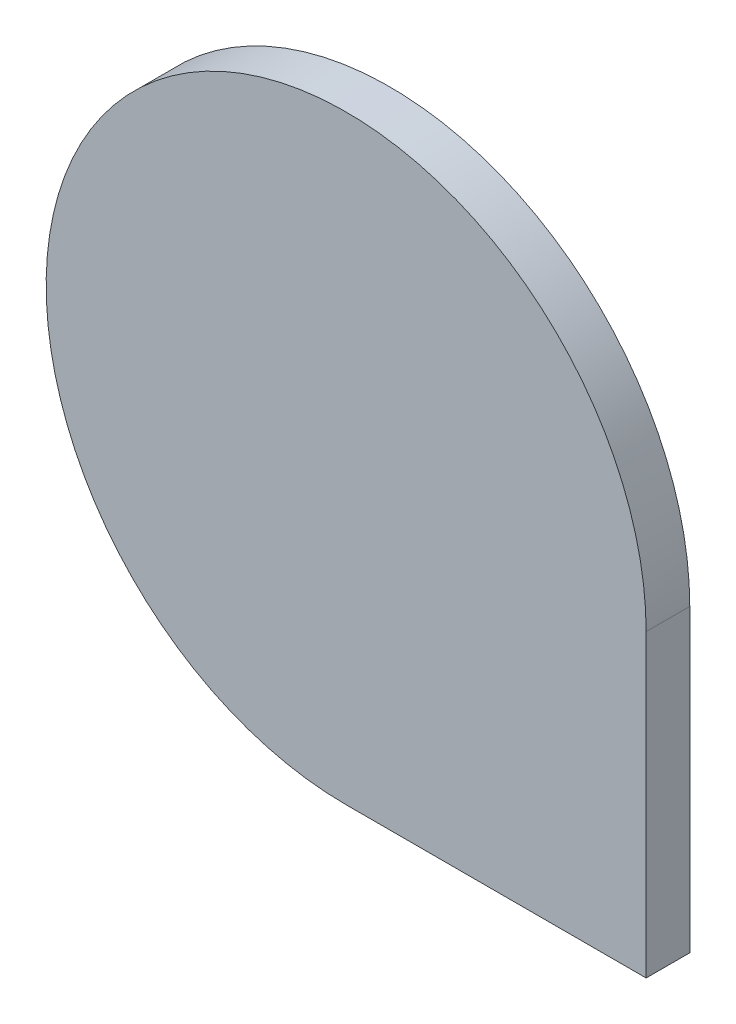
ISO-10303-21;
HEADER;
FILE_DESCRIPTION(('STEP AP214'),'2;1');
FILE_NAME('part.step','',(''),(''),'','','');
FILE_SCHEMA(('AUTOMOTIVE_DESIGN { 1 0 10303 214 1 1 1 1 }'));
ENDSEC;
DATA;
#1=APPLICATION_CONTEXT('core data for automotive mechanical design processes');
#2=APPLICATION_PROTOCOL_DEFINITION('international standard','automotive_design',2000,#1);
#3=PRODUCT_CONTEXT('',#1,'mechanical');
#4=PRODUCT('Part','Part','',(#3));
#5=PRODUCT_RELATED_PRODUCT_CATEGORY('part','',(#4));
#6=PRODUCT_DEFINITION_FORMATION('','',#4);
#7=PRODUCT_DEFINITION_CONTEXT('part definition',#1,'design');
#8=PRODUCT_DEFINITION('design','',#6,#7);
#9=PRODUCT_DEFINITION_SHAPE('','',#8);
#10=(LENGTH_UNIT() NAMED_UNIT(*) SI_UNIT(.MILLI.,.METRE.));
#11=(NAMED_UNIT(*) PLANE_ANGLE_UNIT() SI_UNIT($,.RADIAN.));
#12=(NAMED_UNIT(*) SI_UNIT($,.STERADIAN.) SOLID_ANGLE_UNIT());
#13=UNCERTAINTY_MEASURE_WITH_UNIT(LENGTH_MEASURE(1.E-05),#10,'distance_accuracy_value','');
#14=(GEOMETRIC_REPRESENTATION_CONTEXT(3) GLOBAL_UNCERTAINTY_ASSIGNED_CONTEXT((#13)) GLOBAL_UNIT_ASSIGNED_CONTEXT((#10,
#11,#12)) REPRESENTATION_CONTEXT('',''));
#15=CARTESIAN_POINT('',(0.,0.,0.));
#16=DIRECTION('',(0.,0.,1.));
#17=DIRECTION('',(1.,0.,0.));
#18=AXIS2_PLACEMENT_3D('',#15,#16,#17);
#19=CARTESIAN_POINT('',(0.,0.,8.));
#20=DIRECTION('',(0.,0.,-1.));
#21=DIRECTION('',(-1.,0.,0.));
#22=AXIS2_PLACEMENT_3D('',#19,#20,#21);
#23=CYLINDRICAL_SURFACE('',#22,55.);
#24=CARTESIAN_POINT('',(0.,0.,0.));
#25=DIRECTION('',(0.,0.,1.));
#26=DIRECTION('',(1.,0.,0.));
#27=AXIS2_PLACEMENT_3D('',#24,#25,#26);
#28=CIRCLE('',#27,55.);
#29=CARTESIAN_POINT('',(55.,0.,0.));
#30=VERTEX_POINT('',#29);
#31=CARTESIAN_POINT('',(0.,-55.,0.));
#32=VERTEX_POINT('',#31);
#33=EDGE_CURVE('E93',#30,#32,#28,.T.);
#34=ORIENTED_EDGE('',*,*,#33,.T.);
#35=DIRECTION('',(0.,0.,-1.));
#36=VECTOR('',#35,1.);
#37=CARTESIAN_POINT('',(0.,-55.,8.));
#38=LINE('',#37,#36);
#39=CARTESIAN_POINT('',(0.,-55.,8.));
#40=VERTEX_POINT('',#39);
#41=EDGE_CURVE('E11',#40,#32,#38,.T.);
#42=ORIENTED_EDGE('',*,*,#41,.F.);
#43=CARTESIAN_POINT('',(0.,0.,8.));
#44=DIRECTION('',(0.,0.,1.));
#45=DIRECTION('',(1.,0.,0.));
#46=AXIS2_PLACEMENT_3D('',#43,#44,#45);
#47=CIRCLE('',#46,55.);
#48=CARTESIAN_POINT('',(55.,0.,8.));
#49=VERTEX_POINT('',#48);
#50=EDGE_CURVE('E85',#49,#40,#47,.T.);
#51=ORIENTED_EDGE('',*,*,#50,.F.);
#52=DIRECTION('',(0.,0.,-1.));
#53=VECTOR('',#52,1.);
#54=CARTESIAN_POINT('',(55.,0.,8.));
#55=LINE('',#54,#53);
#56=EDGE_CURVE('E94',#49,#30,#55,.T.);
#57=ORIENTED_EDGE('',*,*,#56,.T.);
#58=EDGE_LOOP('',(#34,#42,#51,#57));
#59=FACE_BOUND('',#58,.T.);
#60=ADVANCED_FACE('F43',(#59),#23,.T.);
#61=CARTESIAN_POINT('',(55.,-55.,8.));
#62=DIRECTION('',(0.,1.,0.));
#63=DIRECTION('',(0.,0.,1.));
#64=AXIS2_PLACEMENT_3D('',#61,#62,#63);
#65=PLANE('',#64);
#66=DIRECTION('',(1.,0.,0.));
#67=VECTOR('',#66,1.);
#68=CARTESIAN_POINT('',(55.,-55.,0.));
#69=LINE('',#68,#67);
#70=CARTESIAN_POINT('',(55.,-55.,0.));
#71=VERTEX_POINT('',#70);
#72=EDGE_CURVE('E72',#32,#71,#69,.T.);
#73=ORIENTED_EDGE('',*,*,#72,.T.);
#74=DIRECTION('',(0.,0.,-1.));
#75=VECTOR('',#74,1.);
#76=CARTESIAN_POINT('',(55.,-55.,8.));
#77=LINE('',#76,#75);
#78=CARTESIAN_POINT('',(55.,-55.,8.));
#79=VERTEX_POINT('',#78);
#80=EDGE_CURVE('E52',#79,#71,#77,.T.);
#81=ORIENTED_EDGE('',*,*,#80,.F.);
#82=DIRECTION('',(1.,0.,0.));
#83=VECTOR('',#82,1.);
#84=CARTESIAN_POINT('',(55.,-55.,8.));
#85=LINE('',#84,#83);
#86=EDGE_CURVE('E80',#40,#79,#85,.T.);
#87=ORIENTED_EDGE('',*,*,#86,.F.);
#88=ORIENTED_EDGE('',*,*,#41,.T.);
#89=EDGE_LOOP('',(#73,#81,#87,#88));
#90=FACE_BOUND('',#89,.T.);
#91=ADVANCED_FACE('F81',(#90),#65,.F.);
#92=CARTESIAN_POINT('',(55.,0.,8.));
#93=DIRECTION('',(-1.,0.,0.));
#94=DIRECTION('',(0.,0.,1.));
#95=AXIS2_PLACEMENT_3D('',#92,#93,#94);
#96=PLANE('',#95);
#97=DIRECTION('',(0.,1.,0.));
#98=VECTOR('',#97,1.);
#99=CARTESIAN_POINT('',(55.,0.,0.));
#100=LINE('',#99,#98);
#101=EDGE_CURVE('E77',#71,#30,#100,.T.);
#102=ORIENTED_EDGE('',*,*,#101,.T.);
#103=ORIENTED_EDGE('',*,*,#56,.F.);
#104=DIRECTION('',(0.,1.,0.));
#105=VECTOR('',#104,1.);
#106=CARTESIAN_POINT('',(55.,0.,8.));
#107=LINE('',#106,#105);
#108=EDGE_CURVE('E60',#79,#49,#107,.T.);
#109=ORIENTED_EDGE('',*,*,#108,.F.);
#110=ORIENTED_EDGE('',*,*,#80,.T.);
#111=EDGE_LOOP('',(#102,#103,#109,#110));
#112=FACE_BOUND('',#111,.T.);
#113=ADVANCED_FACE('F106',(#112),#96,.F.);
#114=CARTESIAN_POINT('',(0.,0.,8.));
#115=DIRECTION('',(0.,0.,1.));
#116=DIRECTION('',(1.,0.,0.));
#117=AXIS2_PLACEMENT_3D('',#114,#115,#116);
#118=PLANE('',#117);
#119=ORIENTED_EDGE('',*,*,#50,.T.);
#120=ORIENTED_EDGE('',*,*,#86,.T.);
#121=ORIENTED_EDGE('',*,*,#108,.T.);
#122=EDGE_LOOP('',(#119,#120,#121));
#123=FACE_BOUND('',#122,.T.);
#124=ADVANCED_FACE('F88',(#123),#118,.T.);
#125=CARTESIAN_POINT('',(0.,0.,0.));
#126=DIRECTION('',(0.,0.,1.));
#127=DIRECTION('',(1.,0.,0.));
#128=AXIS2_PLACEMENT_3D('',#125,#126,#127);
#129=PLANE('',#128);
#130=ORIENTED_EDGE('',*,*,#33,.F.);
#131=ORIENTED_EDGE('',*,*,#101,.F.);
#132=ORIENTED_EDGE('',*,*,#72,.F.);
#133=EDGE_LOOP('',(#130,#131,#132));
#134=FACE_BOUND('',#133,.T.);
#135=ADVANCED_FACE('F107',(#134),#129,.F.);
#136=CLOSED_SHELL('',(#60,#91,#113,#124,#135));
#137=MANIFOLD_SOLID_BREP('B2',#136);
#138=ADVANCED_BREP_SHAPE_REPRESENTATION('',(#18,#137),#14);
#139=SHAPE_DEFINITION_REPRESENTATION(#9,#138);
ENDSEC;
END-ISO-10303-21;
